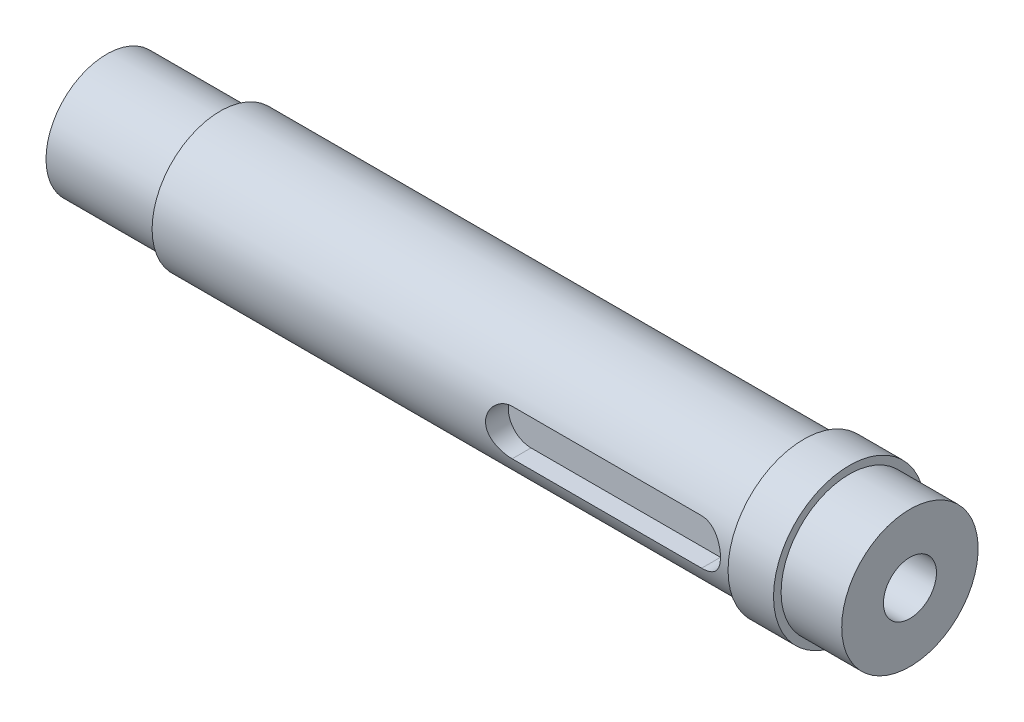
ISO-10303-21;
HEADER;
FILE_DESCRIPTION(('STEP AP214'),'2;1');
FILE_NAME('part.step','',(''),(''),'','','');
FILE_SCHEMA(('AUTOMOTIVE_DESIGN { 1 0 10303 214 1 1 1 1 }'));
ENDSEC;
DATA;
#1=APPLICATION_CONTEXT('core data for automotive mechanical design processes');
#2=APPLICATION_PROTOCOL_DEFINITION('international standard','automotive_design',2000,#1);
#3=PRODUCT_CONTEXT('',#1,'mechanical');
#4=PRODUCT('Part','Part','',(#3));
#5=PRODUCT_RELATED_PRODUCT_CATEGORY('part','',(#4));
#6=PRODUCT_DEFINITION_FORMATION('','',#4);
#7=PRODUCT_DEFINITION_CONTEXT('part definition',#1,'design');
#8=PRODUCT_DEFINITION('design','',#6,#7);
#9=PRODUCT_DEFINITION_SHAPE('','',#8);
#10=(LENGTH_UNIT() NAMED_UNIT(*) SI_UNIT(.MILLI.,.METRE.));
#11=(NAMED_UNIT(*) PLANE_ANGLE_UNIT() SI_UNIT($,.RADIAN.));
#12=(NAMED_UNIT(*) SI_UNIT($,.STERADIAN.) SOLID_ANGLE_UNIT());
#13=UNCERTAINTY_MEASURE_WITH_UNIT(LENGTH_MEASURE(1.E-05),#10,'distance_accuracy_value','');
#14=(GEOMETRIC_REPRESENTATION_CONTEXT(3) GLOBAL_UNCERTAINTY_ASSIGNED_CONTEXT((#13)) GLOBAL_UNIT_ASSIGNED_CONTEXT((#10,
#11,#12)) REPRESENTATION_CONTEXT('',''));
#15=CARTESIAN_POINT('',(0.,0.,0.));
#16=DIRECTION('',(0.,0.,1.));
#17=DIRECTION('',(1.,0.,0.));
#18=AXIS2_PLACEMENT_3D('',#15,#16,#17);
#19=CARTESIAN_POINT('',(0.,0.,0.));
#20=DIRECTION('',(1.,0.,0.));
#21=DIRECTION('',(0.,0.,-1.));
#22=AXIS2_PLACEMENT_3D('',#19,#20,#21);
#23=PLANE('',#22);
#24=CARTESIAN_POINT('',(0.,0.,0.));
#25=DIRECTION('',(1.,0.,0.));
#26=DIRECTION('',(0.,0.,-1.));
#27=AXIS2_PLACEMENT_3D('',#24,#25,#26);
#28=CIRCLE('',#27,3.5);
#29=CARTESIAN_POINT('',(0.,0.,-3.5));
#30=VERTEX_POINT('',#29);
#31=EDGE_CURVE('E98',#30,#30,#28,.T.);
#32=ORIENTED_EDGE('',*,*,#31,.T.);
#33=EDGE_LOOP('',(#32));
#34=FACE_BOUND('',#33,.T.);
#35=CARTESIAN_POINT('',(0.,0.,0.));
#36=DIRECTION('',(-1.,0.,0.));
#37=DIRECTION('',(0.,0.,1.));
#38=AXIS2_PLACEMENT_3D('',#35,#36,#37);
#39=CIRCLE('',#38,8.);
#40=CARTESIAN_POINT('',(0.,0.,8.));
#41=VERTEX_POINT('',#40);
#42=EDGE_CURVE('E133',#41,#41,#39,.T.);
#43=ORIENTED_EDGE('',*,*,#42,.T.);
#44=EDGE_LOOP('',(#43));
#45=FACE_BOUND('',#44,.T.);
#46=ADVANCED_FACE('F39',(#34,#45),#23,.F.);
#47=CARTESIAN_POINT('',(0.,0.,0.));
#48=DIRECTION('',(-1.,0.,0.));
#49=DIRECTION('',(0.,0.,1.));
#50=AXIS2_PLACEMENT_3D('',#47,#48,#49);
#51=CYLINDRICAL_SURFACE('',#50,8.);
#52=ORIENTED_EDGE('',*,*,#42,.F.);
#53=EDGE_LOOP('',(#52));
#54=FACE_BOUND('',#53,.T.);
#55=CARTESIAN_POINT('',(15.,0.,0.));
#56=DIRECTION('',(-1.,0.,0.));
#57=DIRECTION('',(0.,0.,1.));
#58=AXIS2_PLACEMENT_3D('',#55,#56,#57);
#59=CIRCLE('',#58,8.);
#60=CARTESIAN_POINT('',(15.,0.,8.));
#61=VERTEX_POINT('',#60);
#62=EDGE_CURVE('E130',#61,#61,#59,.T.);
#63=ORIENTED_EDGE('',*,*,#62,.T.);
#64=EDGE_LOOP('',(#63));
#65=FACE_BOUND('',#64,.T.);
#66=ADVANCED_FACE('F190',(#54,#65),#51,.T.);
#67=CARTESIAN_POINT('',(15.,0.,-9.));
#68=DIRECTION('',(1.,0.,0.));
#69=DIRECTION('',(0.,0.,-1.));
#70=AXIS2_PLACEMENT_3D('',#67,#68,#69);
#71=PLANE('',#70);
#72=ORIENTED_EDGE('',*,*,#62,.F.);
#73=EDGE_LOOP('',(#72));
#74=FACE_BOUND('',#73,.T.);
#75=CARTESIAN_POINT('',(15.,0.,0.));
#76=DIRECTION('',(-1.,0.,0.));
#77=DIRECTION('',(0.,0.,1.));
#78=AXIS2_PLACEMENT_3D('',#75,#76,#77);
#79=CIRCLE('',#78,9.);
#80=CARTESIAN_POINT('',(15.,0.,9.));
#81=VERTEX_POINT('',#80);
#82=EDGE_CURVE('E127',#81,#81,#79,.T.);
#83=ORIENTED_EDGE('',*,*,#82,.T.);
#84=EDGE_LOOP('',(#83));
#85=FACE_BOUND('',#84,.T.);
#86=ADVANCED_FACE('F185',(#74,#85),#71,.F.);
#87=CARTESIAN_POINT('',(0.,0.,0.));
#88=DIRECTION('',(-1.,0.,0.));
#89=DIRECTION('',(0.,0.,1.));
#90=AXIS2_PLACEMENT_3D('',#87,#88,#89);
#91=CYLINDRICAL_SURFACE('',#90,9.);
#92=DIRECTION('',(-1.,0.,0.));
#93=VECTOR('',#92,1.);
#94=CARTESIAN_POINT('',(0.,3.,8.48528137423857));
#95=LINE('',#94,#93);
#96=CARTESIAN_POINT('',(62.,3.,8.48528137423857));
#97=VERTEX_POINT('',#96);
#98=CARTESIAN_POINT('',(87.,3.,8.48528137423857));
#99=VERTEX_POINT('',#98);
#100=EDGE_CURVE('E11',#97,#99,#95,.F.);
#101=ORIENTED_EDGE('',*,*,#100,.T.);
#102=CARTESIAN_POINT('',(87.,3.,8.48528137423857));
#103=CARTESIAN_POINT('',(87.0818484933844,3.00001078932486,8.48526831927789));
#104=CARTESIAN_POINT('',(87.1636896896105,2.99665064665901,8.48646532685483));
#105=CARTESIAN_POINT('',(87.3267372460191,2.98327254936564,8.49118228945209));
#106=CARTESIAN_POINT('',(87.4079437715857,2.97325639196642,8.49470161740771));
#107=CARTESIAN_POINT('',(87.5689085860255,2.94668951307354,8.50395246303008));
#108=CARTESIAN_POINT('',(87.648670443061,2.93015817315762,8.50967741820142));
#109=CARTESIAN_POINT('',(87.8064099222994,2.89073017236145,8.52315143887203));
#110=CARTESIAN_POINT('',(87.884387479908,2.8678332814324,8.53090057752397));
#111=CARTESIAN_POINT('',(88.1147538956573,2.7898986156743,8.55683928952693));
#112=CARTESIAN_POINT('',(88.2638149889627,2.72557700172275,8.57773492660859));
#113=CARTESIAN_POINT('',(88.5490521737574,2.57421340927529,8.62436440905027));
#114=CARTESIAN_POINT('',(88.6852202829412,2.4871574792233,8.65010122261302));
#115=CARTESIAN_POINT('',(88.9461514841598,2.28915595016085,8.70463418867365));
#116=CARTESIAN_POINT('',(89.0703421713023,2.17747541556634,8.73350627313643));
#117=CARTESIAN_POINT('',(89.2986205239,1.93496485428979,8.79041552071283));
#118=CARTESIAN_POINT('',(89.402704609656,1.80413142497752,8.81845253440363));
#119=CARTESIAN_POINT('',(89.5904378690398,1.52281106991367,8.87141647315468));
#120=CARTESIAN_POINT('',(89.6734827690068,1.37190030336069,8.8962431223892));
#121=CARTESIAN_POINT('',(89.8127769392055,1.05728771462316,8.9390882626048));
#122=CARTESIAN_POINT('',(89.8690343949709,0.893589817668318,8.95710883299482));
#123=CARTESIAN_POINT('',(89.9512071304868,0.564088045229084,8.98377213313373));
#124=CARTESIAN_POINT('',(89.9781098013917,0.398555505085336,8.99271926928151));
#125=CARTESIAN_POINT('',(90.0039489118423,0.0650969066624176,9.0013082524901));
#126=CARTESIAN_POINT('',(90.0028920150987,-0.102828571762974,9.00095231678789));
#127=CARTESIAN_POINT('',(89.9734671340687,-0.42931153773399,8.99118115872284));
#128=CARTESIAN_POINT('',(89.9461720359939,-0.587978116884624,8.98212182877037));
#129=CARTESIAN_POINT('',(89.8668204541081,-0.898332184121464,8.9564088159923));
#130=CARTESIAN_POINT('',(89.8147625972955,-1.05001928471038,8.93975471206725));
#131=CARTESIAN_POINT('',(89.6867357048648,-1.34445790368094,8.90027004455731));
#132=CARTESIAN_POINT('',(89.6104611658558,-1.48706564697704,8.8773611217211));
#133=CARTESIAN_POINT('',(89.4364208447953,-1.75777363724201,8.82775164383326));
#134=CARTESIAN_POINT('',(89.3386492166759,-1.88586992347829,8.80105005807909));
#135=CARTESIAN_POINT('',(89.1189841175416,-2.13029252762403,8.74518810577395));
#136=CARTESIAN_POINT('',(88.9961729486756,-2.24578277403273,8.71597116015319));
#137=CARTESIAN_POINT('',(88.7326859547076,-2.4548141346411,8.65942491449435));
#138=CARTESIAN_POINT('',(88.5920043807076,-2.5483481578384,8.63209622629495));
#139=CARTESIAN_POINT('',(88.2939199217636,-2.71201733554396,8.58210018141277));
#140=CARTESIAN_POINT('',(88.1363008488814,-2.78178668333576,8.55950759277136));
#141=CARTESIAN_POINT('',(87.8923158654452,-2.86551808116445,8.5316849132946));
#142=CARTESIAN_POINT('',(87.8097432429298,-2.889939000529,8.52342263559069));
#143=CARTESIAN_POINT('',(87.6426296037896,-2.9316254907929,8.50917513666655));
#144=CARTESIAN_POINT('',(87.5580895046639,-2.94889432902108,8.50318887578236));
#145=CARTESIAN_POINT('',(87.3947667222494,-2.97496555991272,8.49410161473166));
#146=CARTESIAN_POINT('',(87.3160871393639,-2.98435073218189,8.49080270505212));
#147=CARTESIAN_POINT('',(87.1582744704951,-2.99686829404165,8.48638843638536));
#148=CARTESIAN_POINT('',(87.0791421023582,-3.0000087520931,8.48527025982562));
#149=CARTESIAN_POINT('',(87.,-3.,8.48528137423857));
#150=B_SPLINE_CURVE_WITH_KNOTS('',3,(#102,#103,#104,#105,#106,#107,#108,#109,#110,#111,#112,
#113,#114,#115,#116,#117,#118,#119,#120,#121,#122,#123,#124,#125,#126,#127,#128,#129,#130,#131,
#132,#133,#134,#135,#136,#137,#138,#139,#140,#141,#142,#143,#144,#145,#146,#147,#148,#149),
.UNSPECIFIED.,.F.,.F.,(4,2,2,2,2,2,2,2,2,2,2,2,2,2,2,2,2,2,2,2,2,2,2,4),(0.,0.245455454206294,
0.490844658508378,0.735509315314879,0.980182815366468,1.46881220307906,1.95774215958628,
2.46393436906068,2.97021661609276,3.48971320817339,4.00905095381417,4.51032334200243,
5.01147626109962,5.4929717741524,5.97449398742779,6.46234978495937,6.9503384178434,
7.46126084192186,7.97234804765762,8.49098011802154,8.75020549988895,9.0093123272696,
9.24695816264698,9.48429674853612),.UNSPECIFIED.);
#151=CARTESIAN_POINT('',(87.,-3.,8.48528137423857));
#152=VERTEX_POINT('',#151);
#153=EDGE_CURVE('E136',#99,#152,#150,.T.);
#154=ORIENTED_EDGE('',*,*,#153,.T.);
#155=DIRECTION('',(-1.,0.,0.));
#156=VECTOR('',#155,1.);
#157=CARTESIAN_POINT('',(0.,-3.,8.48528137423857));
#158=LINE('',#157,#156);
#159=CARTESIAN_POINT('',(62.,-3.,8.48528137423857));
#160=VERTEX_POINT('',#159);
#161=EDGE_CURVE('E46',#152,#160,#158,.T.);
#162=ORIENTED_EDGE('',*,*,#161,.T.);
#163=CARTESIAN_POINT('',(62.,-3.,8.48528137423857));
#164=CARTESIAN_POINT('',(61.9181515066156,-3.00001078932487,8.48526831927788));
#165=CARTESIAN_POINT('',(61.8363103103895,-2.99665064665902,8.48646532685483));
#166=CARTESIAN_POINT('',(61.6732627539809,-2.98327254936565,8.49118228945209));
#167=CARTESIAN_POINT('',(61.5920562284143,-2.97325639196643,8.49470161740771));
#168=CARTESIAN_POINT('',(61.4310914139745,-2.94668951307354,8.50395246303008));
#169=CARTESIAN_POINT('',(61.351329556939,-2.93015817315762,8.50967741820142));
#170=CARTESIAN_POINT('',(61.1935900777006,-2.89073017236145,8.52315143887203));
#171=CARTESIAN_POINT('',(61.115612520092,-2.86783328143241,8.53090057752397));
#172=CARTESIAN_POINT('',(60.8852461043427,-2.78989861567431,8.55683928952693));
#173=CARTESIAN_POINT('',(60.7361850110373,-2.72557700172276,8.57773492660859));
#174=CARTESIAN_POINT('',(60.4509478262426,-2.5742134092753,8.62436440905027));
#175=CARTESIAN_POINT('',(60.3147797170588,-2.48715747922331,8.65010122261301));
#176=CARTESIAN_POINT('',(60.0538485158402,-2.28915595016087,8.70463418867364));
#177=CARTESIAN_POINT('',(59.9296578286977,-2.17747541556635,8.73350627313642));
#178=CARTESIAN_POINT('',(59.7013794761,-1.93496485428979,8.79041552071283));
#179=CARTESIAN_POINT('',(59.597295390344,-1.80413142497752,8.81845253440362));
#180=CARTESIAN_POINT('',(59.4095621309602,-1.52281106991368,8.87141647315468));
#181=CARTESIAN_POINT('',(59.3265172309932,-1.37190030336069,8.8962431223892));
#182=CARTESIAN_POINT('',(59.1872230607945,-1.05728771462316,8.9390882626048));
#183=CARTESIAN_POINT('',(59.1309656050291,-0.893589817668323,8.95710883299482));
#184=CARTESIAN_POINT('',(59.0487928695132,-0.56408804522909,8.98377213313373));
#185=CARTESIAN_POINT('',(59.0218901986083,-0.398555505085342,8.99271926928151));
#186=CARTESIAN_POINT('',(58.9960510881577,-0.0650969066624229,9.0013082524901));
#187=CARTESIAN_POINT('',(58.9971079849012,0.102828571762969,9.00095231678788));
#188=CARTESIAN_POINT('',(59.0265328659313,0.429311537733985,8.99118115872284));
#189=CARTESIAN_POINT('',(59.0538279640061,0.587978116884617,8.98212182877037));
#190=CARTESIAN_POINT('',(59.1331795458919,0.898332184121457,8.9564088159923));
#191=CARTESIAN_POINT('',(59.1852374027045,1.05001928471038,8.93975471206725));
#192=CARTESIAN_POINT('',(59.3132642951352,1.34445790368094,8.90027004455731));
#193=CARTESIAN_POINT('',(59.3895388341442,1.48706564697703,8.87736112172109));
#194=CARTESIAN_POINT('',(59.5635791552047,1.757773637242,8.82775164383326));
#195=CARTESIAN_POINT('',(59.6613507833241,1.88586992347828,8.80105005807909));
#196=CARTESIAN_POINT('',(59.8810158824584,2.13029252762403,8.74518810577395));
#197=CARTESIAN_POINT('',(60.0038270513244,2.24578277403273,8.71597116015319));
#198=CARTESIAN_POINT('',(60.2673140452924,2.45481413464109,8.65942491449435));
#199=CARTESIAN_POINT('',(60.4079956192924,2.54834815783839,8.63209622629495));
#200=CARTESIAN_POINT('',(60.7060800782364,2.71201733554395,8.58210018141277));
#201=CARTESIAN_POINT('',(60.8636991511186,2.78178668333575,8.55950759277136));
#202=CARTESIAN_POINT('',(61.1076841345548,2.86551808116444,8.5316849132946));
#203=CARTESIAN_POINT('',(61.1902567570702,2.88993900052899,8.52342263559069));
#204=CARTESIAN_POINT('',(61.3573703962103,2.93162549079289,8.50917513666655));
#205=CARTESIAN_POINT('',(61.441910495336,2.94889432902107,8.50318887578236));
#206=CARTESIAN_POINT('',(61.6052332777506,2.97496555991272,8.49410161473166));
#207=CARTESIAN_POINT('',(61.6839128606361,2.98435073218189,8.49080270505212));
#208=CARTESIAN_POINT('',(61.8417255295049,2.99686829404165,8.48638843638536));
#209=CARTESIAN_POINT('',(61.9208578976418,3.00000875209309,8.48527025982562));
#210=CARTESIAN_POINT('',(62.,3.,8.48528137423857));
#211=B_SPLINE_CURVE_WITH_KNOTS('',3,(#163,#164,#165,#166,#167,#168,#169,#170,#171,#172,#173,
#174,#175,#176,#177,#178,#179,#180,#181,#182,#183,#184,#185,#186,#187,#188,#189,#190,#191,#192,
#193,#194,#195,#196,#197,#198,#199,#200,#201,#202,#203,#204,#205,#206,#207,#208,#209,#210),
.UNSPECIFIED.,.F.,.F.,(4,2,2,2,2,2,2,2,2,2,2,2,2,2,2,2,2,2,2,2,2,2,2,4),(0.,0.245455454206301,
0.490844658508393,0.735509315314893,0.980182815366468,1.46881220307906,1.95774215958628,
2.46393436906067,2.97021661609277,3.48971320817338,4.00905095381416,4.51032334200243,
5.01147626109962,5.4929717741524,5.97449398742778,6.46234978495938,6.9503384178434,
7.46126084192185,7.97234804765761,8.49098011802154,8.75020549988894,9.00931232726958,
9.24695816264694,9.48429674853609),.UNSPECIFIED.);
#212=EDGE_CURVE('E53',#160,#97,#211,.T.);
#213=ORIENTED_EDGE('',*,*,#212,.T.);
#214=EDGE_LOOP('',(#101,#154,#162,#213));
#215=FACE_BOUND('',#214,.T.);
#216=ORIENTED_EDGE('',*,*,#82,.F.);
#217=EDGE_LOOP('',(#216));
#218=FACE_BOUND('',#217,.T.);
#219=CARTESIAN_POINT('',(92.,0.,0.));
#220=DIRECTION('',(-1.,0.,0.));
#221=DIRECTION('',(0.,0.,1.));
#222=AXIS2_PLACEMENT_3D('',#219,#220,#221);
#223=CIRCLE('',#222,9.);
#224=CARTESIAN_POINT('',(92.,0.,9.));
#225=VERTEX_POINT('',#224);
#226=EDGE_CURVE('E124',#225,#225,#223,.T.);
#227=ORIENTED_EDGE('',*,*,#226,.T.);
#228=EDGE_LOOP('',(#227));
#229=FACE_BOUND('',#228,.T.);
#230=ADVANCED_FACE('F148',(#215,#218,#229),#91,.T.);
#231=CARTESIAN_POINT('',(92.,0.,-9.));
#232=DIRECTION('',(1.,0.,0.));
#233=DIRECTION('',(0.,0.,-1.));
#234=AXIS2_PLACEMENT_3D('',#231,#232,#233);
#235=PLANE('',#234);
#236=ORIENTED_EDGE('',*,*,#226,.F.);
#237=EDGE_LOOP('',(#236));
#238=FACE_BOUND('',#237,.T.);
#239=CARTESIAN_POINT('',(92.,0.,0.));
#240=DIRECTION('',(-1.,0.,0.));
#241=DIRECTION('',(0.,0.,1.));
#242=AXIS2_PLACEMENT_3D('',#239,#240,#241);
#243=CIRCLE('',#242,10.);
#244=CARTESIAN_POINT('',(92.,0.,10.));
#245=VERTEX_POINT('',#244);
#246=EDGE_CURVE('E121',#245,#245,#243,.T.);
#247=ORIENTED_EDGE('',*,*,#246,.T.);
#248=EDGE_LOOP('',(#247));
#249=FACE_BOUND('',#248,.T.);
#250=ADVANCED_FACE('F178',(#238,#249),#235,.F.);
#251=CARTESIAN_POINT('',(0.,0.,0.));
#252=DIRECTION('',(-1.,0.,0.));
#253=DIRECTION('',(0.,0.,1.));
#254=AXIS2_PLACEMENT_3D('',#251,#252,#253);
#255=CYLINDRICAL_SURFACE('',#254,10.);
#256=ORIENTED_EDGE('',*,*,#246,.F.);
#257=EDGE_LOOP('',(#256));
#258=FACE_BOUND('',#257,.T.);
#259=CARTESIAN_POINT('',(98.,0.,0.));
#260=DIRECTION('',(-1.,0.,0.));
#261=DIRECTION('',(0.,0.,1.));
#262=AXIS2_PLACEMENT_3D('',#259,#260,#261);
#263=CIRCLE('',#262,10.);
#264=CARTESIAN_POINT('',(98.,0.,10.));
#265=VERTEX_POINT('',#264);
#266=EDGE_CURVE('E118',#265,#265,#263,.T.);
#267=ORIENTED_EDGE('',*,*,#266,.T.);
#268=EDGE_LOOP('',(#267));
#269=FACE_BOUND('',#268,.T.);
#270=ADVANCED_FACE('F175',(#258,#269),#255,.T.);
#271=CARTESIAN_POINT('',(98.,0.,-10.));
#272=DIRECTION('',(-1.,0.,0.));
#273=DIRECTION('',(0.,0.,1.));
#274=AXIS2_PLACEMENT_3D('',#271,#272,#273);
#275=PLANE('',#274);
#276=ORIENTED_EDGE('',*,*,#266,.F.);
#277=EDGE_LOOP('',(#276));
#278=FACE_BOUND('',#277,.T.);
#279=CARTESIAN_POINT('',(98.,0.,0.));
#280=DIRECTION('',(-1.,0.,0.));
#281=DIRECTION('',(0.,0.,1.));
#282=AXIS2_PLACEMENT_3D('',#279,#280,#281);
#283=CIRCLE('',#282,9.);
#284=CARTESIAN_POINT('',(98.,0.,9.));
#285=VERTEX_POINT('',#284);
#286=EDGE_CURVE('E115',#285,#285,#283,.T.);
#287=ORIENTED_EDGE('',*,*,#286,.T.);
#288=EDGE_LOOP('',(#287));
#289=FACE_BOUND('',#288,.T.);
#290=ADVANCED_FACE('F171',(#278,#289),#275,.F.);
#291=CARTESIAN_POINT('',(0.,0.,0.));
#292=DIRECTION('',(-1.,0.,0.));
#293=DIRECTION('',(0.,0.,1.));
#294=AXIS2_PLACEMENT_3D('',#291,#292,#293);
#295=CYLINDRICAL_SURFACE('',#294,9.);
#296=ORIENTED_EDGE('',*,*,#286,.F.);
#297=EDGE_LOOP('',(#296));
#298=FACE_BOUND('',#297,.T.);
#299=CARTESIAN_POINT('',(106.,0.,0.));
#300=DIRECTION('',(-1.,0.,0.));
#301=DIRECTION('',(0.,0.,1.));
#302=AXIS2_PLACEMENT_3D('',#299,#300,#301);
#303=CIRCLE('',#302,9.);
#304=CARTESIAN_POINT('',(106.,0.,9.));
#305=VERTEX_POINT('',#304);
#306=EDGE_CURVE('E109',#305,#305,#303,.T.);
#307=ORIENTED_EDGE('',*,*,#306,.T.);
#308=EDGE_LOOP('',(#307));
#309=FACE_BOUND('',#308,.T.);
#310=ADVANCED_FACE('F167',(#298,#309),#295,.T.);
#311=CARTESIAN_POINT('',(106.,0.,-9.));
#312=DIRECTION('',(-1.,0.,0.));
#313=DIRECTION('',(0.,0.,1.));
#314=AXIS2_PLACEMENT_3D('',#311,#312,#313);
#315=PLANE('',#314);
#316=CARTESIAN_POINT('',(106.,0.,0.));
#317=DIRECTION('',(1.,0.,0.));
#318=DIRECTION('',(0.,0.,-1.));
#319=AXIS2_PLACEMENT_3D('',#316,#317,#318);
#320=CIRCLE('',#319,3.5);
#321=CARTESIAN_POINT('',(106.,0.,-3.5));
#322=VERTEX_POINT('',#321);
#323=EDGE_CURVE('E101',#322,#322,#320,.T.);
#324=ORIENTED_EDGE('',*,*,#323,.F.);
#325=EDGE_LOOP('',(#324));
#326=FACE_BOUND('',#325,.T.);
#327=ORIENTED_EDGE('',*,*,#306,.F.);
#328=EDGE_LOOP('',(#327));
#329=FACE_BOUND('',#328,.T.);
#330=ADVANCED_FACE('F164',(#326,#329),#315,.F.);
#331=CARTESIAN_POINT('',(62.,0.,6.));
#332=DIRECTION('',(0.,0.,1.));
#333=DIRECTION('',(1.,0.,0.));
#334=AXIS2_PLACEMENT_3D('',#331,#332,#333);
#335=CYLINDRICAL_SURFACE('',#334,3.);
#336=DIRECTION('',(0.,0.,1.));
#337=VECTOR('',#336,1.);
#338=CARTESIAN_POINT('',(62.,-3.,6.));
#339=LINE('',#338,#337);
#340=CARTESIAN_POINT('',(62.,-3.,6.));
#341=VERTEX_POINT('',#340);
#342=EDGE_CURVE('E76',#341,#160,#339,.T.);
#343=ORIENTED_EDGE('',*,*,#342,.F.);
#344=CARTESIAN_POINT('',(62.,0.,6.));
#345=DIRECTION('',(0.,0.,1.));
#346=DIRECTION('',(1.,0.,0.));
#347=AXIS2_PLACEMENT_3D('',#344,#345,#346);
#348=CIRCLE('',#347,3.);
#349=CARTESIAN_POINT('',(62.,3.,6.));
#350=VERTEX_POINT('',#349);
#351=EDGE_CURVE('E80',#350,#341,#348,.T.);
#352=ORIENTED_EDGE('',*,*,#351,.F.);
#353=DIRECTION('',(0.,0.,1.));
#354=VECTOR('',#353,1.);
#355=CARTESIAN_POINT('',(62.,3.,6.));
#356=LINE('',#355,#354);
#357=EDGE_CURVE('E107',#350,#97,#356,.T.);
#358=ORIENTED_EDGE('',*,*,#357,.T.);
#359=ORIENTED_EDGE('',*,*,#212,.F.);
#360=EDGE_LOOP('',(#343,#352,#358,#359));
#361=FACE_BOUND('',#360,.T.);
#362=ADVANCED_FACE('F78',(#361),#335,.F.);
#363=CARTESIAN_POINT('',(62.,3.,6.));
#364=DIRECTION('',(0.,1.,0.));
#365=DIRECTION('',(-1.,0.,0.));
#366=AXIS2_PLACEMENT_3D('',#363,#364,#365);
#367=PLANE('',#366);
#368=ORIENTED_EDGE('',*,*,#357,.F.);
#369=DIRECTION('',(-1.,0.,0.));
#370=VECTOR('',#369,1.);
#371=CARTESIAN_POINT('',(62.,3.,6.));
#372=LINE('',#371,#370);
#373=CARTESIAN_POINT('',(87.,3.,6.));
#374=VERTEX_POINT('',#373);
#375=EDGE_CURVE('E85',#374,#350,#372,.T.);
#376=ORIENTED_EDGE('',*,*,#375,.F.);
#377=DIRECTION('',(0.,0.,1.));
#378=VECTOR('',#377,1.);
#379=CARTESIAN_POINT('',(87.,3.,6.));
#380=LINE('',#379,#378);
#381=EDGE_CURVE('E110',#374,#99,#380,.T.);
#382=ORIENTED_EDGE('',*,*,#381,.T.);
#383=ORIENTED_EDGE('',*,*,#100,.F.);
#384=EDGE_LOOP('',(#368,#376,#382,#383));
#385=FACE_BOUND('',#384,.T.);
#386=ADVANCED_FACE('F157',(#385),#367,.F.);
#387=CARTESIAN_POINT('',(87.,0.,6.));
#388=DIRECTION('',(0.,0.,1.));
#389=DIRECTION('',(1.,0.,0.));
#390=AXIS2_PLACEMENT_3D('',#387,#388,#389);
#391=CYLINDRICAL_SURFACE('',#390,3.);
#392=ORIENTED_EDGE('',*,*,#381,.F.);
#393=CARTESIAN_POINT('',(87.,0.,6.));
#394=DIRECTION('',(0.,0.,1.));
#395=DIRECTION('',(1.,0.,0.));
#396=AXIS2_PLACEMENT_3D('',#393,#394,#395);
#397=CIRCLE('',#396,3.);
#398=CARTESIAN_POINT('',(87.,-3.,6.));
#399=VERTEX_POINT('',#398);
#400=EDGE_CURVE('E94',#399,#374,#397,.T.);
#401=ORIENTED_EDGE('',*,*,#400,.F.);
#402=DIRECTION('',(0.,0.,1.));
#403=VECTOR('',#402,1.);
#404=CARTESIAN_POINT('',(87.,-3.,6.));
#405=LINE('',#404,#403);
#406=EDGE_CURVE('E84',#399,#152,#405,.T.);
#407=ORIENTED_EDGE('',*,*,#406,.T.);
#408=ORIENTED_EDGE('',*,*,#153,.F.);
#409=EDGE_LOOP('',(#392,#401,#407,#408));
#410=FACE_BOUND('',#409,.T.);
#411=ADVANCED_FACE('F152',(#410),#391,.F.);
#412=CARTESIAN_POINT('',(62.,-3.,6.));
#413=DIRECTION('',(0.,-1.,0.));
#414=DIRECTION('',(1.,0.,0.));
#415=AXIS2_PLACEMENT_3D('',#412,#413,#414);
#416=PLANE('',#415);
#417=ORIENTED_EDGE('',*,*,#406,.F.);
#418=DIRECTION('',(1.,0.,0.));
#419=VECTOR('',#418,1.);
#420=CARTESIAN_POINT('',(62.,-3.,6.));
#421=LINE('',#420,#419);
#422=EDGE_CURVE('E88',#341,#399,#421,.T.);
#423=ORIENTED_EDGE('',*,*,#422,.F.);
#424=ORIENTED_EDGE('',*,*,#342,.T.);
#425=ORIENTED_EDGE('',*,*,#161,.F.);
#426=EDGE_LOOP('',(#417,#423,#424,#425));
#427=FACE_BOUND('',#426,.T.);
#428=ADVANCED_FACE('F89',(#427),#416,.F.);
#429=CARTESIAN_POINT('',(62.,0.,6.));
#430=DIRECTION('',(0.,0.,1.));
#431=DIRECTION('',(1.,0.,0.));
#432=AXIS2_PLACEMENT_3D('',#429,#430,#431);
#433=PLANE('',#432);
#434=ORIENTED_EDGE('',*,*,#351,.T.);
#435=ORIENTED_EDGE('',*,*,#422,.T.);
#436=ORIENTED_EDGE('',*,*,#400,.T.);
#437=ORIENTED_EDGE('',*,*,#375,.T.);
#438=EDGE_LOOP('',(#434,#435,#436,#437));
#439=FACE_BOUND('',#438,.T.);
#440=ADVANCED_FACE('F96',(#439),#433,.T.);
#441=CARTESIAN_POINT('',(0.,0.,0.));
#442=DIRECTION('',(1.,0.,0.));
#443=DIRECTION('',(0.,0.,-1.));
#444=AXIS2_PLACEMENT_3D('',#441,#442,#443);
#445=CYLINDRICAL_SURFACE('',#444,3.5);
#446=ORIENTED_EDGE('',*,*,#31,.F.);
#447=EDGE_LOOP('',(#446));
#448=FACE_BOUND('',#447,.T.);
#449=ORIENTED_EDGE('',*,*,#323,.T.);
#450=EDGE_LOOP('',(#449));
#451=FACE_BOUND('',#450,.T.);
#452=ADVANCED_FACE('F256',(#448,#451),#445,.F.);
#453=CLOSED_SHELL('',(#46,#66,#86,#230,#250,#270,#290,#310,#330,#362,#386,#411,#428,#440,#452));
#454=MANIFOLD_SOLID_BREP('B2',#453);
#455=ADVANCED_BREP_SHAPE_REPRESENTATION('',(#18,#454),#14);
#456=SHAPE_DEFINITION_REPRESENTATION(#9,#455);
ENDSEC;
END-ISO-10303-21;
